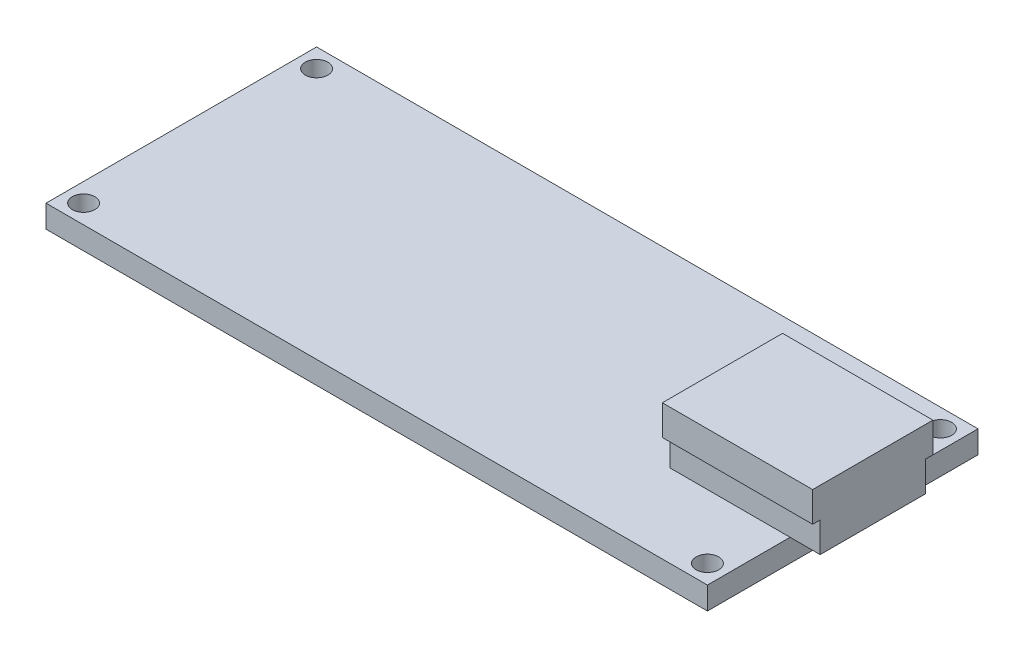
ISO-10303-21;
HEADER;
FILE_DESCRIPTION(('STEP AP214'),'2;1');
FILE_NAME('part.step','',(''),(''),'','','');
FILE_SCHEMA(('AUTOMOTIVE_DESIGN { 1 0 10303 214 1 1 1 1 }'));
ENDSEC;
DATA;
#1=APPLICATION_CONTEXT('core data for automotive mechanical design processes');
#2=APPLICATION_PROTOCOL_DEFINITION('international standard','automotive_design',2000,#1);
#3=PRODUCT_CONTEXT('',#1,'mechanical');
#4=PRODUCT('Part','Part','',(#3));
#5=PRODUCT_RELATED_PRODUCT_CATEGORY('part','',(#4));
#6=PRODUCT_DEFINITION_FORMATION('','',#4);
#7=PRODUCT_DEFINITION_CONTEXT('part definition',#1,'design');
#8=PRODUCT_DEFINITION('design','',#6,#7);
#9=PRODUCT_DEFINITION_SHAPE('','',#8);
#10=(LENGTH_UNIT() NAMED_UNIT(*) SI_UNIT(.MILLI.,.METRE.));
#11=(NAMED_UNIT(*) PLANE_ANGLE_UNIT() SI_UNIT($,.RADIAN.));
#12=(NAMED_UNIT(*) SI_UNIT($,.STERADIAN.) SOLID_ANGLE_UNIT());
#13=UNCERTAINTY_MEASURE_WITH_UNIT(LENGTH_MEASURE(1.E-05),#10,'distance_accuracy_value','');
#14=(GEOMETRIC_REPRESENTATION_CONTEXT(3) GLOBAL_UNCERTAINTY_ASSIGNED_CONTEXT((#13)) GLOBAL_UNIT_ASSIGNED_CONTEXT((#10,
#11,#12)) REPRESENTATION_CONTEXT('',''));
#15=CARTESIAN_POINT('',(0.,0.,0.));
#16=DIRECTION('',(0.,0.,1.));
#17=DIRECTION('',(1.,0.,0.));
#18=AXIS2_PLACEMENT_3D('',#15,#16,#17);
#19=CARTESIAN_POINT('',(-22.,1.5,9.00000000000001));
#20=DIRECTION('',(1.,0.,0.));
#21=DIRECTION('',(0.,0.,-1.));
#22=AXIS2_PLACEMENT_3D('',#19,#20,#21);
#23=PLANE('',#22);
#24=DIRECTION('',(0.,0.,1.));
#25=VECTOR('',#24,1.);
#26=CARTESIAN_POINT('',(-22.,0.,9.00000000000001));
#27=LINE('',#26,#25);
#28=CARTESIAN_POINT('',(-22.,0.,-8.99999999999999));
#29=VERTEX_POINT('',#28);
#30=CARTESIAN_POINT('',(-22.,0.,9.00000000000001));
#31=VERTEX_POINT('',#30);
#32=EDGE_CURVE('E250',#29,#31,#27,.T.);
#33=ORIENTED_EDGE('',*,*,#32,.T.);
#34=DIRECTION('',(0.,-1.,0.));
#35=VECTOR('',#34,1.);
#36=CARTESIAN_POINT('',(-22.,1.5,9.00000000000001));
#37=LINE('',#36,#35);
#38=CARTESIAN_POINT('',(-22.,1.5,9.00000000000001));
#39=VERTEX_POINT('',#38);
#40=EDGE_CURVE('E43',#39,#31,#37,.T.);
#41=ORIENTED_EDGE('',*,*,#40,.F.);
#42=DIRECTION('',(0.,0.,1.));
#43=VECTOR('',#42,1.);
#44=CARTESIAN_POINT('',(-22.,1.5,9.00000000000001));
#45=LINE('',#44,#43);
#46=CARTESIAN_POINT('',(-22.,1.5,-8.99999999999999));
#47=VERTEX_POINT('',#46);
#48=EDGE_CURVE('E245',#47,#39,#45,.T.);
#49=ORIENTED_EDGE('',*,*,#48,.F.);
#50=DIRECTION('',(0.,-1.,0.));
#51=VECTOR('',#50,1.);
#52=CARTESIAN_POINT('',(-22.,1.5,-8.99999999999999));
#53=LINE('',#52,#51);
#54=EDGE_CURVE('E239',#47,#29,#53,.T.);
#55=ORIENTED_EDGE('',*,*,#54,.T.);
#56=EDGE_LOOP('',(#33,#41,#49,#55));
#57=FACE_BOUND('',#56,.T.);
#58=ADVANCED_FACE('F35',(#57),#23,.F.);
#59=CARTESIAN_POINT('',(22.,1.5,9.));
#60=DIRECTION('',(0.,0.,-1.));
#61=DIRECTION('',(-1.,0.,0.));
#62=AXIS2_PLACEMENT_3D('',#59,#60,#61);
#63=PLANE('',#62);
#64=DIRECTION('',(1.,0.,0.));
#65=VECTOR('',#64,1.);
#66=CARTESIAN_POINT('',(22.,0.,9.));
#67=LINE('',#66,#65);
#68=CARTESIAN_POINT('',(22.,0.,9.));
#69=VERTEX_POINT('',#68);
#70=EDGE_CURVE('E248',#31,#69,#67,.T.);
#71=ORIENTED_EDGE('',*,*,#70,.T.);
#72=DIRECTION('',(0.,-1.,0.));
#73=VECTOR('',#72,1.);
#74=CARTESIAN_POINT('',(22.,1.5,9.));
#75=LINE('',#74,#73);
#76=CARTESIAN_POINT('',(22.,1.5,9.));
#77=VERTEX_POINT('',#76);
#78=EDGE_CURVE('E233',#77,#69,#75,.T.);
#79=ORIENTED_EDGE('',*,*,#78,.F.);
#80=DIRECTION('',(1.,0.,0.));
#81=VECTOR('',#80,1.);
#82=CARTESIAN_POINT('',(22.,1.5,9.));
#83=LINE('',#82,#81);
#84=EDGE_CURVE('E259',#39,#77,#83,.T.);
#85=ORIENTED_EDGE('',*,*,#84,.F.);
#86=ORIENTED_EDGE('',*,*,#40,.T.);
#87=EDGE_LOOP('',(#71,#79,#85,#86));
#88=FACE_BOUND('',#87,.T.);
#89=ADVANCED_FACE('F313',(#88),#63,.F.);
#90=CARTESIAN_POINT('',(22.,1.5,9.));
#91=DIRECTION('',(-1.,0.,0.));
#92=DIRECTION('',(0.,0.,1.));
#93=AXIS2_PLACEMENT_3D('',#90,#91,#92);
#94=PLANE('',#93);
#95=DIRECTION('',(0.,0.,-1.));
#96=VECTOR('',#95,1.);
#97=CARTESIAN_POINT('',(22.,0.,9.));
#98=LINE('',#97,#96);
#99=CARTESIAN_POINT('',(22.,0.,-9.));
#100=VERTEX_POINT('',#99);
#101=EDGE_CURVE('E246',#69,#100,#98,.T.);
#102=ORIENTED_EDGE('',*,*,#101,.T.);
#103=DIRECTION('',(0.,-1.,0.));
#104=VECTOR('',#103,1.);
#105=CARTESIAN_POINT('',(22.,1.5,-9.));
#106=LINE('',#105,#104);
#107=CARTESIAN_POINT('',(22.,1.5,-9.));
#108=VERTEX_POINT('',#107);
#109=EDGE_CURVE('E236',#108,#100,#106,.T.);
#110=ORIENTED_EDGE('',*,*,#109,.F.);
#111=DIRECTION('',(0.,0.,-1.));
#112=VECTOR('',#111,1.);
#113=CARTESIAN_POINT('',(22.,1.5,9.));
#114=LINE('',#113,#112);
#115=CARTESIAN_POINT('',(22.,1.5,-3.5));
#116=VERTEX_POINT('',#115);
#117=EDGE_CURVE('E258',#116,#108,#114,.T.);
#118=ORIENTED_EDGE('',*,*,#117,.F.);
#119=CARTESIAN_POINT('',(22.,1.5,3.5));
#120=VERTEX_POINT('',#119);
#121=EDGE_CURVE('E257',#120,#116,#114,.T.);
#122=ORIENTED_EDGE('',*,*,#121,.F.);
#123=EDGE_CURVE('E255',#77,#120,#114,.T.);
#124=ORIENTED_EDGE('',*,*,#123,.F.);
#125=ORIENTED_EDGE('',*,*,#78,.T.);
#126=EDGE_LOOP('',(#102,#110,#118,#122,#124,#125));
#127=FACE_BOUND('',#126,.T.);
#128=ADVANCED_FACE('F299',(#127),#94,.F.);
#129=CARTESIAN_POINT('',(22.,1.5,-9.));
#130=DIRECTION('',(0.,0.,1.));
#131=DIRECTION('',(1.,0.,0.));
#132=AXIS2_PLACEMENT_3D('',#129,#130,#131);
#133=PLANE('',#132);
#134=DIRECTION('',(-1.,0.,0.));
#135=VECTOR('',#134,1.);
#136=CARTESIAN_POINT('',(22.,0.,-9.));
#137=LINE('',#136,#135);
#138=EDGE_CURVE('E243',#100,#29,#137,.T.);
#139=ORIENTED_EDGE('',*,*,#138,.T.);
#140=ORIENTED_EDGE('',*,*,#54,.F.);
#141=DIRECTION('',(-1.,0.,0.));
#142=VECTOR('',#141,1.);
#143=CARTESIAN_POINT('',(22.,1.5,-9.));
#144=LINE('',#143,#142);
#145=EDGE_CURVE('E242',#108,#47,#144,.T.);
#146=ORIENTED_EDGE('',*,*,#145,.F.);
#147=ORIENTED_EDGE('',*,*,#109,.T.);
#148=EDGE_LOOP('',(#139,#140,#146,#147));
#149=FACE_BOUND('',#148,.T.);
#150=ADVANCED_FACE('F306',(#149),#133,.F.);
#151=CARTESIAN_POINT('',(0.,1.5,0.));
#152=DIRECTION('',(0.,1.,0.));
#153=DIRECTION('',(0.,0.,1.));
#154=AXIS2_PLACEMENT_3D('',#151,#152,#153);
#155=PLANE('',#154);
#156=DIRECTION('',(-1.,0.,0.));
#157=VECTOR('',#156,1.);
#158=CARTESIAN_POINT('',(14.,1.5,-3.5));
#159=LINE('',#158,#157);
#160=CARTESIAN_POINT('',(14.,1.5,-3.5));
#161=VERTEX_POINT('',#160);
#162=EDGE_CURVE('E11',#116,#161,#159,.T.);
#163=ORIENTED_EDGE('',*,*,#162,.F.);
#164=ORIENTED_EDGE('',*,*,#117,.T.);
#165=ORIENTED_EDGE('',*,*,#145,.T.);
#166=ORIENTED_EDGE('',*,*,#48,.T.);
#167=ORIENTED_EDGE('',*,*,#84,.T.);
#168=ORIENTED_EDGE('',*,*,#123,.T.);
#169=DIRECTION('',(1.,0.,0.));
#170=VECTOR('',#169,1.);
#171=CARTESIAN_POINT('',(14.,1.5,3.5));
#172=LINE('',#171,#170);
#173=CARTESIAN_POINT('',(14.,1.5,3.5));
#174=VERTEX_POINT('',#173);
#175=EDGE_CURVE('E56',#174,#120,#172,.T.);
#176=ORIENTED_EDGE('',*,*,#175,.F.);
#177=DIRECTION('',(0.,0.,1.));
#178=VECTOR('',#177,1.);
#179=CARTESIAN_POINT('',(14.,1.5,3.5));
#180=LINE('',#179,#178);
#181=EDGE_CURVE('E52',#161,#174,#180,.T.);
#182=ORIENTED_EDGE('',*,*,#181,.F.);
#183=EDGE_LOOP('',(#163,#164,#165,#166,#167,#168,#176,#182));
#184=FACE_BOUND('',#183,.T.);
#185=CARTESIAN_POINT('',(-20.75,1.5,7.75000000000001));
#186=DIRECTION('',(0.,1.,0.));
#187=DIRECTION('',(0.,0.,1.));
#188=AXIS2_PLACEMENT_3D('',#185,#186,#187);
#189=CIRCLE('',#188,0.750000000000002);
#190=CARTESIAN_POINT('',(-20.75,1.5,8.50000000000001));
#191=VERTEX_POINT('',#190);
#192=EDGE_CURVE('E281',#191,#191,#189,.T.);
#193=ORIENTED_EDGE('',*,*,#192,.F.);
#194=EDGE_LOOP('',(#193));
#195=FACE_BOUND('',#194,.T.);
#196=CARTESIAN_POINT('',(20.75,1.5,7.75000000000001));
#197=DIRECTION('',(0.,1.,0.));
#198=DIRECTION('',(0.,0.,1.));
#199=AXIS2_PLACEMENT_3D('',#196,#197,#198);
#200=CIRCLE('',#199,0.750000000000002);
#201=CARTESIAN_POINT('',(20.75,1.5,8.50000000000001));
#202=VERTEX_POINT('',#201);
#203=EDGE_CURVE('E275',#202,#202,#200,.T.);
#204=ORIENTED_EDGE('',*,*,#203,.F.);
#205=EDGE_LOOP('',(#204));
#206=FACE_BOUND('',#205,.T.);
#207=CARTESIAN_POINT('',(20.75,1.5,-7.75));
#208=DIRECTION('',(0.,1.,0.));
#209=DIRECTION('',(0.,0.,1.));
#210=AXIS2_PLACEMENT_3D('',#207,#208,#209);
#211=CIRCLE('',#210,0.750000000000002);
#212=CARTESIAN_POINT('',(20.75,1.5,-7.));
#213=VERTEX_POINT('',#212);
#214=EDGE_CURVE('E269',#213,#213,#211,.T.);
#215=ORIENTED_EDGE('',*,*,#214,.F.);
#216=EDGE_LOOP('',(#215));
#217=FACE_BOUND('',#216,.T.);
#218=CARTESIAN_POINT('',(-20.75,1.5,-7.75));
#219=DIRECTION('',(0.,1.,0.));
#220=DIRECTION('',(0.,0.,1.));
#221=AXIS2_PLACEMENT_3D('',#218,#219,#220);
#222=CIRCLE('',#221,0.750000000000002);
#223=CARTESIAN_POINT('',(-20.75,1.5,-7.));
#224=VERTEX_POINT('',#223);
#225=EDGE_CURVE('E263',#224,#224,#222,.T.);
#226=ORIENTED_EDGE('',*,*,#225,.F.);
#227=EDGE_LOOP('',(#226));
#228=FACE_BOUND('',#227,.T.);
#229=ADVANCED_FACE('F295',(#184,#195,#206,#217,#228),#155,.T.);
#230=CARTESIAN_POINT('',(0.,0.,0.));
#231=DIRECTION('',(0.,1.,0.));
#232=DIRECTION('',(0.,0.,1.));
#233=AXIS2_PLACEMENT_3D('',#230,#231,#232);
#234=PLANE('',#233);
#235=CARTESIAN_POINT('',(-20.75,0.,7.75000000000001));
#236=DIRECTION('',(0.,1.,0.));
#237=DIRECTION('',(0.,0.,1.));
#238=AXIS2_PLACEMENT_3D('',#235,#236,#237);
#239=CIRCLE('',#238,0.750000000000002);
#240=CARTESIAN_POINT('',(-20.75,0.,8.50000000000001));
#241=VERTEX_POINT('',#240);
#242=EDGE_CURVE('E278',#241,#241,#239,.T.);
#243=ORIENTED_EDGE('',*,*,#242,.T.);
#244=EDGE_LOOP('',(#243));
#245=FACE_BOUND('',#244,.T.);
#246=CARTESIAN_POINT('',(20.75,0.,7.75000000000001));
#247=DIRECTION('',(0.,1.,0.));
#248=DIRECTION('',(0.,0.,1.));
#249=AXIS2_PLACEMENT_3D('',#246,#247,#248);
#250=CIRCLE('',#249,0.750000000000002);
#251=CARTESIAN_POINT('',(20.75,0.,8.50000000000001));
#252=VERTEX_POINT('',#251);
#253=EDGE_CURVE('E272',#252,#252,#250,.T.);
#254=ORIENTED_EDGE('',*,*,#253,.T.);
#255=EDGE_LOOP('',(#254));
#256=FACE_BOUND('',#255,.T.);
#257=CARTESIAN_POINT('',(20.75,0.,-7.75));
#258=DIRECTION('',(0.,1.,0.));
#259=DIRECTION('',(0.,0.,1.));
#260=AXIS2_PLACEMENT_3D('',#257,#258,#259);
#261=CIRCLE('',#260,0.750000000000002);
#262=CARTESIAN_POINT('',(20.75,0.,-7.));
#263=VERTEX_POINT('',#262);
#264=EDGE_CURVE('E266',#263,#263,#261,.T.);
#265=ORIENTED_EDGE('',*,*,#264,.T.);
#266=EDGE_LOOP('',(#265));
#267=FACE_BOUND('',#266,.T.);
#268=CARTESIAN_POINT('',(-20.75,0.,-7.75));
#269=DIRECTION('',(0.,1.,0.));
#270=DIRECTION('',(0.,0.,1.));
#271=AXIS2_PLACEMENT_3D('',#268,#269,#270);
#272=CIRCLE('',#271,0.750000000000002);
#273=CARTESIAN_POINT('',(-20.75,0.,-7.));
#274=VERTEX_POINT('',#273);
#275=EDGE_CURVE('E253',#274,#274,#272,.T.);
#276=ORIENTED_EDGE('',*,*,#275,.T.);
#277=EDGE_LOOP('',(#276));
#278=FACE_BOUND('',#277,.T.);
#279=ORIENTED_EDGE('',*,*,#32,.F.);
#280=ORIENTED_EDGE('',*,*,#138,.F.);
#281=ORIENTED_EDGE('',*,*,#101,.F.);
#282=ORIENTED_EDGE('',*,*,#70,.F.);
#283=EDGE_LOOP('',(#279,#280,#281,#282));
#284=FACE_BOUND('',#283,.T.);
#285=ADVANCED_FACE('F315',(#245,#256,#267,#278,#284),#234,.F.);
#286=CARTESIAN_POINT('',(-20.75,0.,-7.75));
#287=DIRECTION('',(0.,1.,0.));
#288=DIRECTION('',(0.,0.,1.));
#289=AXIS2_PLACEMENT_3D('',#286,#287,#288);
#290=CYLINDRICAL_SURFACE('',#289,0.750000000000002);
#291=ORIENTED_EDGE('',*,*,#275,.F.);
#292=EDGE_LOOP('',(#291));
#293=FACE_BOUND('',#292,.T.);
#294=ORIENTED_EDGE('',*,*,#225,.T.);
#295=EDGE_LOOP('',(#294));
#296=FACE_BOUND('',#295,.T.);
#297=ADVANCED_FACE('F317',(#293,#296),#290,.F.);
#298=CARTESIAN_POINT('',(20.75,0.,-7.75));
#299=DIRECTION('',(0.,1.,0.));
#300=DIRECTION('',(0.,0.,1.));
#301=AXIS2_PLACEMENT_3D('',#298,#299,#300);
#302=CYLINDRICAL_SURFACE('',#301,0.750000000000002);
#303=ORIENTED_EDGE('',*,*,#264,.F.);
#304=EDGE_LOOP('',(#303));
#305=FACE_BOUND('',#304,.T.);
#306=ORIENTED_EDGE('',*,*,#214,.T.);
#307=EDGE_LOOP('',(#306));
#308=FACE_BOUND('',#307,.T.);
#309=ADVANCED_FACE('F324',(#305,#308),#302,.F.);
#310=CARTESIAN_POINT('',(20.75,0.,7.75000000000001));
#311=DIRECTION('',(0.,1.,0.));
#312=DIRECTION('',(0.,0.,1.));
#313=AXIS2_PLACEMENT_3D('',#310,#311,#312);
#314=CYLINDRICAL_SURFACE('',#313,0.750000000000002);
#315=ORIENTED_EDGE('',*,*,#253,.F.);
#316=EDGE_LOOP('',(#315));
#317=FACE_BOUND('',#316,.T.);
#318=ORIENTED_EDGE('',*,*,#203,.T.);
#319=EDGE_LOOP('',(#318));
#320=FACE_BOUND('',#319,.T.);
#321=ADVANCED_FACE('F440',(#317,#320),#314,.F.);
#322=CARTESIAN_POINT('',(-20.75,0.,7.75000000000001));
#323=DIRECTION('',(0.,1.,0.));
#324=DIRECTION('',(0.,0.,1.));
#325=AXIS2_PLACEMENT_3D('',#322,#323,#324);
#326=CYLINDRICAL_SURFACE('',#325,0.750000000000002);
#327=ORIENTED_EDGE('',*,*,#242,.F.);
#328=EDGE_LOOP('',(#327));
#329=FACE_BOUND('',#328,.T.);
#330=ORIENTED_EDGE('',*,*,#192,.T.);
#331=EDGE_LOOP('',(#330));
#332=FACE_BOUND('',#331,.T.);
#333=ADVANCED_FACE('F371',(#329,#332),#326,.F.);
#334=CARTESIAN_POINT('',(14.,3.5,3.5));
#335=DIRECTION('',(1.,0.,0.));
#336=DIRECTION('',(0.,0.,-1.));
#337=AXIS2_PLACEMENT_3D('',#334,#335,#336);
#338=PLANE('',#337);
#339=ORIENTED_EDGE('',*,*,#181,.T.);
#340=DIRECTION('',(0.,-1.,0.));
#341=VECTOR('',#340,1.);
#342=CARTESIAN_POINT('',(14.,3.5,3.5));
#343=LINE('',#342,#341);
#344=CARTESIAN_POINT('',(14.,3.5,3.5));
#345=VERTEX_POINT('',#344);
#346=EDGE_CURVE('E229',#345,#174,#343,.T.);
#347=ORIENTED_EDGE('',*,*,#346,.F.);
#348=DIRECTION('',(0.,0.,1.));
#349=VECTOR('',#348,1.);
#350=CARTESIAN_POINT('',(14.,3.5,4.));
#351=LINE('',#350,#349);
#352=CARTESIAN_POINT('',(14.,3.5,4.));
#353=VERTEX_POINT('',#352);
#354=EDGE_CURVE('E154',#345,#353,#351,.T.);
#355=ORIENTED_EDGE('',*,*,#354,.T.);
#356=DIRECTION('',(0.,-1.,0.));
#357=VECTOR('',#356,1.);
#358=CARTESIAN_POINT('',(14.,5.5,4.));
#359=LINE('',#358,#357);
#360=CARTESIAN_POINT('',(14.,5.5,4.));
#361=VERTEX_POINT('',#360);
#362=EDGE_CURVE('E134',#361,#353,#359,.T.);
#363=ORIENTED_EDGE('',*,*,#362,.F.);
#364=DIRECTION('',(0.,0.,1.));
#365=VECTOR('',#364,1.);
#366=CARTESIAN_POINT('',(14.,5.5,4.));
#367=LINE('',#366,#365);
#368=CARTESIAN_POINT('',(14.,5.5,-4.));
#369=VERTEX_POINT('',#368);
#370=EDGE_CURVE('E140',#369,#361,#367,.T.);
#371=ORIENTED_EDGE('',*,*,#370,.F.);
#372=DIRECTION('',(0.,-1.,0.));
#373=VECTOR('',#372,1.);
#374=CARTESIAN_POINT('',(14.,5.5,-4.));
#375=LINE('',#374,#373);
#376=CARTESIAN_POINT('',(14.,3.5,-4.));
#377=VERTEX_POINT('',#376);
#378=EDGE_CURVE('E199',#369,#377,#375,.T.);
#379=ORIENTED_EDGE('',*,*,#378,.T.);
#380=CARTESIAN_POINT('',(14.,3.5,-3.5));
#381=VERTEX_POINT('',#380);
#382=EDGE_CURVE('E163',#377,#381,#351,.T.);
#383=ORIENTED_EDGE('',*,*,#382,.T.);
#384=DIRECTION('',(0.,-1.,0.));
#385=VECTOR('',#384,1.);
#386=CARTESIAN_POINT('',(14.,3.5,-3.5));
#387=LINE('',#386,#385);
#388=EDGE_CURVE('E204',#381,#161,#387,.T.);
#389=ORIENTED_EDGE('',*,*,#388,.T.);
#390=EDGE_LOOP('',(#339,#347,#355,#363,#371,#379,#383,#389));
#391=FACE_BOUND('',#390,.T.);
#392=ADVANCED_FACE('F151',(#391),#338,.F.);
#393=CARTESIAN_POINT('',(14.,3.5,3.5));
#394=DIRECTION('',(0.,0.,-1.));
#395=DIRECTION('',(-1.,0.,0.));
#396=AXIS2_PLACEMENT_3D('',#393,#394,#395);
#397=PLANE('',#396);
#398=ORIENTED_EDGE('',*,*,#175,.T.);
#399=CARTESIAN_POINT('',(24.,1.5,3.5));
#400=VERTEX_POINT('',#399);
#401=EDGE_CURVE('E157',#120,#400,#172,.T.);
#402=ORIENTED_EDGE('',*,*,#401,.T.);
#403=DIRECTION('',(0.,-1.,0.));
#404=VECTOR('',#403,1.);
#405=CARTESIAN_POINT('',(24.,3.5,3.5));
#406=LINE('',#405,#404);
#407=CARTESIAN_POINT('',(24.,3.5,3.5));
#408=VERTEX_POINT('',#407);
#409=EDGE_CURVE('E218',#408,#400,#406,.T.);
#410=ORIENTED_EDGE('',*,*,#409,.F.);
#411=DIRECTION('',(1.,0.,0.));
#412=VECTOR('',#411,1.);
#413=CARTESIAN_POINT('',(14.,3.5,3.5));
#414=LINE('',#413,#412);
#415=EDGE_CURVE('E208',#345,#408,#414,.T.);
#416=ORIENTED_EDGE('',*,*,#415,.F.);
#417=ORIENTED_EDGE('',*,*,#346,.T.);
#418=EDGE_LOOP('',(#398,#402,#410,#416,#417));
#419=FACE_BOUND('',#418,.T.);
#420=ADVANCED_FACE('F287',(#419),#397,.F.);
#421=CARTESIAN_POINT('',(24.,3.5,3.5));
#422=DIRECTION('',(-1.,0.,0.));
#423=DIRECTION('',(0.,0.,1.));
#424=AXIS2_PLACEMENT_3D('',#421,#422,#423);
#425=PLANE('',#424);
#426=DIRECTION('',(0.,0.,-1.));
#427=VECTOR('',#426,1.);
#428=CARTESIAN_POINT('',(24.,1.5,3.5));
#429=LINE('',#428,#427);
#430=CARTESIAN_POINT('',(24.,1.5,-3.5));
#431=VERTEX_POINT('',#430);
#432=EDGE_CURVE('E213',#400,#431,#429,.T.);
#433=ORIENTED_EDGE('',*,*,#432,.T.);
#434=DIRECTION('',(0.,-1.,0.));
#435=VECTOR('',#434,1.);
#436=CARTESIAN_POINT('',(24.,3.5,-3.5));
#437=LINE('',#436,#435);
#438=CARTESIAN_POINT('',(24.,3.5,-3.5));
#439=VERTEX_POINT('',#438);
#440=EDGE_CURVE('E192',#439,#431,#437,.T.);
#441=ORIENTED_EDGE('',*,*,#440,.F.);
#442=DIRECTION('',(0.,0.,-1.));
#443=VECTOR('',#442,1.);
#444=CARTESIAN_POINT('',(24.,3.5,4.));
#445=LINE('',#444,#443);
#446=CARTESIAN_POINT('',(24.,3.5,-4.));
#447=VERTEX_POINT('',#446);
#448=EDGE_CURVE('E175',#439,#447,#445,.T.);
#449=ORIENTED_EDGE('',*,*,#448,.T.);
#450=DIRECTION('',(0.,-1.,0.));
#451=VECTOR('',#450,1.);
#452=CARTESIAN_POINT('',(24.,5.5,-4.));
#453=LINE('',#452,#451);
#454=CARTESIAN_POINT('',(24.,5.5,-4.));
#455=VERTEX_POINT('',#454);
#456=EDGE_CURVE('E159',#455,#447,#453,.T.);
#457=ORIENTED_EDGE('',*,*,#456,.F.);
#458=DIRECTION('',(0.,0.,-1.));
#459=VECTOR('',#458,1.);
#460=CARTESIAN_POINT('',(24.,5.5,4.));
#461=LINE('',#460,#459);
#462=CARTESIAN_POINT('',(24.,5.5,4.));
#463=VERTEX_POINT('',#462);
#464=EDGE_CURVE('E139',#463,#455,#461,.T.);
#465=ORIENTED_EDGE('',*,*,#464,.F.);
#466=DIRECTION('',(0.,-1.,0.));
#467=VECTOR('',#466,1.);
#468=CARTESIAN_POINT('',(24.,5.5,4.));
#469=LINE('',#468,#467);
#470=CARTESIAN_POINT('',(24.,3.5,4.));
#471=VERTEX_POINT('',#470);
#472=EDGE_CURVE('E136',#463,#471,#469,.T.);
#473=ORIENTED_EDGE('',*,*,#472,.T.);
#474=EDGE_CURVE('E182',#471,#408,#445,.T.);
#475=ORIENTED_EDGE('',*,*,#474,.T.);
#476=ORIENTED_EDGE('',*,*,#409,.T.);
#477=EDGE_LOOP('',(#433,#441,#449,#457,#465,#473,#475,#476));
#478=FACE_BOUND('',#477,.T.);
#479=ADVANCED_FACE('F190',(#478),#425,.F.);
#480=CARTESIAN_POINT('',(14.,3.5,-3.5));
#481=DIRECTION('',(0.,0.,1.));
#482=DIRECTION('',(1.,0.,0.));
#483=AXIS2_PLACEMENT_3D('',#480,#481,#482);
#484=PLANE('',#483);
#485=EDGE_CURVE('E45',#431,#116,#159,.T.);
#486=ORIENTED_EDGE('',*,*,#485,.T.);
#487=ORIENTED_EDGE('',*,*,#162,.T.);
#488=ORIENTED_EDGE('',*,*,#388,.F.);
#489=DIRECTION('',(-1.,0.,0.));
#490=VECTOR('',#489,1.);
#491=CARTESIAN_POINT('',(14.,3.5,-3.5));
#492=LINE('',#491,#490);
#493=EDGE_CURVE('E202',#439,#381,#492,.T.);
#494=ORIENTED_EDGE('',*,*,#493,.F.);
#495=ORIENTED_EDGE('',*,*,#440,.T.);
#496=EDGE_LOOP('',(#486,#487,#488,#494,#495));
#497=FACE_BOUND('',#496,.T.);
#498=ADVANCED_FACE('F293',(#497),#484,.F.);
#499=CARTESIAN_POINT('',(0.,1.5,0.));
#500=DIRECTION('',(0.,-1.,0.));
#501=DIRECTION('',(0.,0.,-1.));
#502=AXIS2_PLACEMENT_3D('',#499,#500,#501);
#503=PLANE('',#502);
#504=ORIENTED_EDGE('',*,*,#401,.F.);
#505=ORIENTED_EDGE('',*,*,#121,.T.);
#506=ORIENTED_EDGE('',*,*,#485,.F.);
#507=ORIENTED_EDGE('',*,*,#432,.F.);
#508=EDGE_LOOP('',(#504,#505,#506,#507));
#509=FACE_BOUND('',#508,.T.);
#510=ADVANCED_FACE('F291',(#509),#503,.T.);
#511=CARTESIAN_POINT('',(0.,3.5,0.));
#512=DIRECTION('',(0.,1.,0.));
#513=DIRECTION('',(0.,0.,1.));
#514=AXIS2_PLACEMENT_3D('',#511,#512,#513);
#515=PLANE('',#514);
#516=ORIENTED_EDGE('',*,*,#354,.F.);
#517=ORIENTED_EDGE('',*,*,#415,.T.);
#518=ORIENTED_EDGE('',*,*,#474,.F.);
#519=DIRECTION('',(1.,0.,0.));
#520=VECTOR('',#519,1.);
#521=CARTESIAN_POINT('',(24.,3.5,4.));
#522=LINE('',#521,#520);
#523=EDGE_CURVE('E167',#353,#471,#522,.T.);
#524=ORIENTED_EDGE('',*,*,#523,.F.);
#525=EDGE_LOOP('',(#516,#517,#518,#524));
#526=FACE_BOUND('',#525,.T.);
#527=ADVANCED_FACE('F207',(#526),#515,.F.);
#528=ORIENTED_EDGE('',*,*,#448,.F.);
#529=ORIENTED_EDGE('',*,*,#493,.T.);
#530=ORIENTED_EDGE('',*,*,#382,.F.);
#531=DIRECTION('',(-1.,0.,0.));
#532=VECTOR('',#531,1.);
#533=CARTESIAN_POINT('',(24.,3.5,-4.));
#534=LINE('',#533,#532);
#535=EDGE_CURVE('E149',#447,#377,#534,.T.);
#536=ORIENTED_EDGE('',*,*,#535,.F.);
#537=EDGE_LOOP('',(#528,#529,#530,#536));
#538=FACE_BOUND('',#537,.T.);
#539=ADVANCED_FACE('F201',(#538),#515,.F.);
#540=CARTESIAN_POINT('',(24.,5.5,4.));
#541=DIRECTION('',(0.,0.,-1.));
#542=DIRECTION('',(-1.,0.,0.));
#543=AXIS2_PLACEMENT_3D('',#540,#541,#542);
#544=PLANE('',#543);
#545=ORIENTED_EDGE('',*,*,#523,.T.);
#546=ORIENTED_EDGE('',*,*,#472,.F.);
#547=DIRECTION('',(1.,0.,0.));
#548=VECTOR('',#547,1.);
#549=CARTESIAN_POINT('',(24.,5.5,4.));
#550=LINE('',#549,#548);
#551=EDGE_CURVE('E130',#361,#463,#550,.T.);
#552=ORIENTED_EDGE('',*,*,#551,.F.);
#553=ORIENTED_EDGE('',*,*,#362,.T.);
#554=EDGE_LOOP('',(#545,#546,#552,#553));
#555=FACE_BOUND('',#554,.T.);
#556=ADVANCED_FACE('F132',(#555),#544,.F.);
#557=CARTESIAN_POINT('',(24.,5.5,-4.));
#558=DIRECTION('',(0.,0.,1.));
#559=DIRECTION('',(1.,0.,0.));
#560=AXIS2_PLACEMENT_3D('',#557,#558,#559);
#561=PLANE('',#560);
#562=ORIENTED_EDGE('',*,*,#535,.T.);
#563=ORIENTED_EDGE('',*,*,#378,.F.);
#564=DIRECTION('',(-1.,0.,0.));
#565=VECTOR('',#564,1.);
#566=CARTESIAN_POINT('',(24.,5.5,-4.));
#567=LINE('',#566,#565);
#568=EDGE_CURVE('E145',#455,#369,#567,.T.);
#569=ORIENTED_EDGE('',*,*,#568,.F.);
#570=ORIENTED_EDGE('',*,*,#456,.T.);
#571=EDGE_LOOP('',(#562,#563,#569,#570));
#572=FACE_BOUND('',#571,.T.);
#573=ADVANCED_FACE('F198',(#572),#561,.F.);
#574=CARTESIAN_POINT('',(0.,5.5,0.));
#575=DIRECTION('',(0.,1.,0.));
#576=DIRECTION('',(0.,0.,1.));
#577=AXIS2_PLACEMENT_3D('',#574,#575,#576);
#578=PLANE('',#577);
#579=ORIENTED_EDGE('',*,*,#370,.T.);
#580=ORIENTED_EDGE('',*,*,#551,.T.);
#581=ORIENTED_EDGE('',*,*,#464,.T.);
#582=ORIENTED_EDGE('',*,*,#568,.T.);
#583=EDGE_LOOP('',(#579,#580,#581,#582));
#584=FACE_BOUND('',#583,.T.);
#585=ADVANCED_FACE('F143',(#584),#578,.T.);
#586=CLOSED_SHELL('',(#58,#89,#128,#150,#229,#285,#297,#309,#321,#333,#392,#420,#479,#498,#510,
#527,#539,#556,#573,#585));
#587=MANIFOLD_SOLID_BREP('B2',#586);
#588=ADVANCED_BREP_SHAPE_REPRESENTATION('',(#18,#587),#14);
#589=SHAPE_DEFINITION_REPRESENTATION(#9,#588);
ENDSEC;
END-ISO-10303-21;
